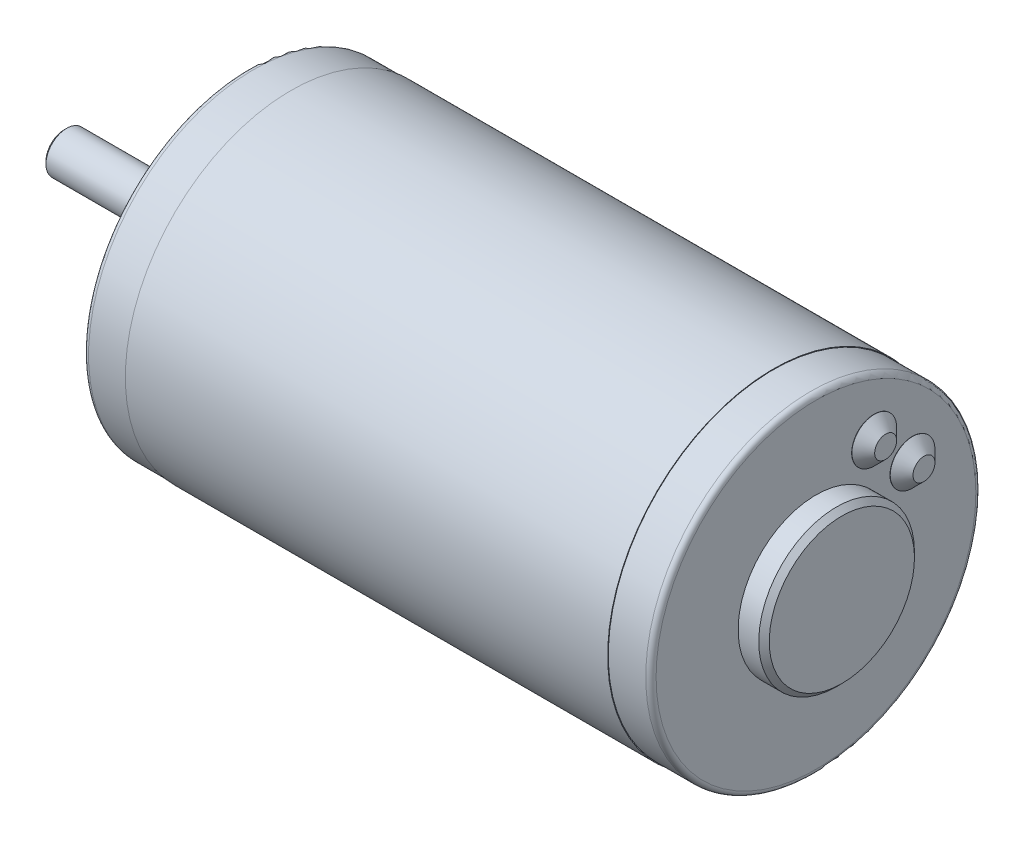
ISO-10303-21;
HEADER;
FILE_DESCRIPTION(('STEP AP214'),'2;1');
FILE_NAME('part.step','',(''),(''),'','','');
FILE_SCHEMA(('AUTOMOTIVE_DESIGN { 1 0 10303 214 1 1 1 1 }'));
ENDSEC;
DATA;
#1=APPLICATION_CONTEXT('core data for automotive mechanical design processes');
#2=APPLICATION_PROTOCOL_DEFINITION('international standard','automotive_design',2000,#1);
#3=PRODUCT_CONTEXT('',#1,'mechanical');
#4=PRODUCT('Part','Part','',(#3));
#5=PRODUCT_RELATED_PRODUCT_CATEGORY('part','',(#4));
#6=PRODUCT_DEFINITION_FORMATION('','',#4);
#7=PRODUCT_DEFINITION_CONTEXT('part definition',#1,'design');
#8=PRODUCT_DEFINITION('design','',#6,#7);
#9=PRODUCT_DEFINITION_SHAPE('','',#8);
#10=(LENGTH_UNIT() NAMED_UNIT(*) SI_UNIT(.MILLI.,.METRE.));
#11=(NAMED_UNIT(*) PLANE_ANGLE_UNIT() SI_UNIT($,.RADIAN.));
#12=(NAMED_UNIT(*) SI_UNIT($,.STERADIAN.) SOLID_ANGLE_UNIT());
#13=UNCERTAINTY_MEASURE_WITH_UNIT(LENGTH_MEASURE(1.E-05),#10,'distance_accuracy_value','');
#14=(GEOMETRIC_REPRESENTATION_CONTEXT(3) GLOBAL_UNCERTAINTY_ASSIGNED_CONTEXT((#13)) GLOBAL_UNIT_ASSIGNED_CONTEXT((#10,
#11,#12)) REPRESENTATION_CONTEXT('',''));
#15=CARTESIAN_POINT('',(0.,0.,0.));
#16=DIRECTION('',(0.,0.,1.));
#17=DIRECTION('',(1.,0.,0.));
#18=AXIS2_PLACEMENT_3D('',#15,#16,#17);
#19=CARTESIAN_POINT('',(-35.6,0.,0.));
#20=DIRECTION('',(-1.,0.,0.));
#21=DIRECTION('',(0.,0.,1.));
#22=AXIS2_PLACEMENT_3D('',#19,#20,#21);
#23=PLANE('',#22);
#24=CARTESIAN_POINT('',(-35.6000000000449,0.,0.));
#25=DIRECTION('',(1.,0.,0.));
#26=DIRECTION('',(0.,0.,-1.));
#27=AXIS2_PLACEMENT_3D('',#24,#25,#26);
#28=CIRCLE('',#27,3.49999999997408);
#29=CARTESIAN_POINT('',(-35.6000000000449,0.,-3.49999999997408));
#30=VERTEX_POINT('',#29);
#31=EDGE_CURVE('E86',#30,#30,#28,.T.);
#32=ORIENTED_EDGE('',*,*,#31,.F.);
#33=EDGE_LOOP('',(#32));
#34=FACE_BOUND('',#33,.T.);
#35=ADVANCED_FACE('F17',(#34),#23,.T.);
#36=CARTESIAN_POINT('',(-27.6,-1.,-2.79999999999999));
#37=DIRECTION('',(0.,0.,1.));
#38=DIRECTION('',(1.,0.,0.));
#39=AXIS2_PLACEMENT_3D('',#36,#37,#38);
#40=PLANE('',#39);
#41=CARTESIAN_POINT('',(-7.1,0.,-2.79999999999999));
#42=DIRECTION('',(0.,0.,-1.));
#43=DIRECTION('',(-1.,0.,0.));
#44=AXIS2_PLACEMENT_3D('',#41,#42,#43);
#45=CIRCLE('',#44,1.);
#46=CARTESIAN_POINT('',(-7.1,1.,-2.79999999999999));
#47=VERTEX_POINT('',#46);
#48=CARTESIAN_POINT('',(-7.1,-1.,-2.79999999999999));
#49=VERTEX_POINT('',#48);
#50=EDGE_CURVE('E355',#47,#49,#45,.T.);
#51=ORIENTED_EDGE('',*,*,#50,.T.);
#52=DIRECTION('',(1.,0.,0.));
#53=VECTOR('',#52,1.);
#54=CARTESIAN_POINT('',(-27.6,-1.,-2.79999999999999));
#55=LINE('',#54,#53);
#56=CARTESIAN_POINT('',(-26.6,-1.,-2.79999999999999));
#57=VERTEX_POINT('',#56);
#58=EDGE_CURVE('E75',#57,#49,#55,.T.);
#59=ORIENTED_EDGE('',*,*,#58,.F.);
#60=CARTESIAN_POINT('',(-26.6,0.,-2.79999999999999));
#61=DIRECTION('',(0.,0.,1.));
#62=DIRECTION('',(1.,0.,0.));
#63=AXIS2_PLACEMENT_3D('',#60,#61,#62);
#64=CIRCLE('',#63,1.);
#65=CARTESIAN_POINT('',(-26.6,1.,-2.79999999999999));
#66=VERTEX_POINT('',#65);
#67=EDGE_CURVE('E77',#57,#66,#64,.F.);
#68=ORIENTED_EDGE('',*,*,#67,.T.);
#69=DIRECTION('',(1.,0.,0.));
#70=VECTOR('',#69,1.);
#71=CARTESIAN_POINT('',(-27.6,1.,-2.79999999999999));
#72=LINE('',#71,#70);
#73=EDGE_CURVE('E80',#66,#47,#72,.T.);
#74=ORIENTED_EDGE('',*,*,#73,.T.);
#75=EDGE_LOOP('',(#51,#59,#68,#74));
#76=FACE_BOUND('',#75,.T.);
#77=ADVANCED_FACE('F79',(#76),#40,.F.);
#78=CARTESIAN_POINT('',(-27.6,1.,-2.79999999999999));
#79=DIRECTION('',(0.,1.,0.));
#80=DIRECTION('',(0.,0.,1.));
#81=AXIS2_PLACEMENT_3D('',#78,#79,#80);
#82=PLANE('',#81);
#83=DIRECTION('',(0.,0.,-1.));
#84=VECTOR('',#83,1.);
#85=CARTESIAN_POINT('',(-7.1,1.,-2.79999999999999));
#86=LINE('',#85,#84);
#87=CARTESIAN_POINT('',(-7.1,1.,-3.87298334620741));
#88=VERTEX_POINT('',#87);
#89=EDGE_CURVE('E94',#88,#47,#86,.F.);
#90=ORIENTED_EDGE('',*,*,#89,.T.);
#91=ORIENTED_EDGE('',*,*,#73,.F.);
#92=DIRECTION('',(0.,0.,1.));
#93=VECTOR('',#92,1.);
#94=CARTESIAN_POINT('',(-26.6,1.,-3.87298334620741));
#95=LINE('',#94,#93);
#96=CARTESIAN_POINT('',(-26.6,1.,-3.87298334620741));
#97=VERTEX_POINT('',#96);
#98=EDGE_CURVE('E85',#66,#97,#95,.F.);
#99=ORIENTED_EDGE('',*,*,#98,.T.);
#100=DIRECTION('',(1.,0.,0.));
#101=VECTOR('',#100,1.);
#102=CARTESIAN_POINT('',(0.,1.,-3.87298334620741));
#103=LINE('',#102,#101);
#104=EDGE_CURVE('E108',#88,#97,#103,.F.);
#105=ORIENTED_EDGE('',*,*,#104,.F.);
#106=EDGE_LOOP('',(#90,#91,#99,#105));
#107=FACE_BOUND('',#106,.T.);
#108=ADVANCED_FACE('F90',(#107),#82,.F.);
#109=CARTESIAN_POINT('',(-35.0999999999999,0.,0.));
#110=DIRECTION('',(1.,0.,0.));
#111=DIRECTION('',(0.,0.,-1.));
#112=AXIS2_PLACEMENT_3D('',#109,#110,#111);
#113=CONICAL_SURFACE('',#112,3.99999999996226,0.785398163340605);
#114=ORIENTED_EDGE('',*,*,#31,.T.);
#115=EDGE_LOOP('',(#114));
#116=FACE_BOUND('',#115,.T.);
#117=CARTESIAN_POINT('',(-35.1,0.,0.));
#118=DIRECTION('',(1.,0.,0.));
#119=DIRECTION('',(0.,0.,-1.));
#120=AXIS2_PLACEMENT_3D('',#117,#118,#119);
#121=CIRCLE('',#120,4.);
#122=CARTESIAN_POINT('',(-35.1,0.,-4.));
#123=VERTEX_POINT('',#122);
#124=EDGE_CURVE('E106',#123,#123,#121,.T.);
#125=ORIENTED_EDGE('',*,*,#124,.F.);
#126=EDGE_LOOP('',(#125));
#127=FACE_BOUND('',#126,.T.);
#128=ADVANCED_FACE('F449',(#116,#127),#113,.T.);
#129=CARTESIAN_POINT('',(-26.6,0.,-3.87298334620741));
#130=DIRECTION('',(0.,0.,1.));
#131=DIRECTION('',(1.,0.,0.));
#132=AXIS2_PLACEMENT_3D('',#129,#130,#131);
#133=CYLINDRICAL_SURFACE('',#132,1.);
#134=CARTESIAN_POINT('',(-26.6,1.,-3.87298334620741));
#135=CARTESIAN_POINT('',(-26.6276629618862,1.00000033683282,-3.87298148578628));
#136=CARTESIAN_POINT('',(-26.6553122166168,0.998851408973519,-3.87328009898513));
#137=CARTESIAN_POINT('',(-26.7104039432582,0.99427130530857,-3.87445904529397));
#138=CARTESIAN_POINT('',(-26.7378464491771,0.990840513520934,-3.87533928052183));
#139=CARTESIAN_POINT('',(-26.8194530833432,0.977175260843417,-3.87881710393726));
#140=CARTESIAN_POINT('',(-26.8730564246123,0.963567703685293,-3.88225202757006));
#141=CARTESIAN_POINT('',(-26.977125593587,0.927797766664205,-3.89095430304382));
#142=CARTESIAN_POINT('',(-27.0275916629555,0.905636046675282,-3.89622151353779));
#143=CARTESIAN_POINT('',(-27.1241130864299,0.853414285079073,-3.90799157486739));
#144=CARTESIAN_POINT('',(-27.1701674100591,0.823352404294525,-3.91449471333242));
#145=CARTESIAN_POINT('',(-27.2575394864378,0.755487979247931,-3.92816193945039));
#146=CARTESIAN_POINT('',(-27.2987466452781,0.717545201468668,-3.9353364874883));
#147=CARTESIAN_POINT('',(-27.374295287631,0.635284227526783,-3.94944965646411));
#148=CARTESIAN_POINT('',(-27.4086343067441,0.590963752716545,-3.95638819197841));
#149=CARTESIAN_POINT('',(-27.4699263913366,0.496434353262424,-3.969365132807));
#150=CARTESIAN_POINT('',(-27.4967663594361,0.446150035120253,-3.97538918749288));
#151=CARTESIAN_POINT('',(-27.5415435234846,0.341642316384397,-3.98572777190495));
#152=CARTESIAN_POINT('',(-27.5594913901323,0.287423727052285,-3.99004434937703));
#153=CARTESIAN_POINT('',(-27.5817561327113,0.194111735626857,-3.99546891720265));
#154=CARTESIAN_POINT('',(-27.5885857933547,0.155632918020193,-3.99715927898668));
#155=CARTESIAN_POINT('',(-27.5977085408135,0.0781080027780982,-3.99942531582645));
#156=CARTESIAN_POINT('',(-27.6000016937716,0.0390619134219042,-4.00000100713419));
#157=CARTESIAN_POINT('',(-27.599997605085,-0.0552317459833931,-3.99999857595864));
#158=CARTESIAN_POINT('',(-27.5954072017814,-0.110495128478836,-3.99884417849431));
#159=CARTESIAN_POINT('',(-27.5771887284744,-0.219452299234418,-3.99434884496973));
#160=CARTESIAN_POINT('',(-27.5635520456883,-0.273144540728258,-3.99100582520556));
#161=CARTESIAN_POINT('',(-27.5277065776784,-0.377348216031198,-3.98250401525138));
#162=CARTESIAN_POINT('',(-27.50550949133,-0.427863881926155,-3.97734770399773));
#163=CARTESIAN_POINT('',(-27.4532106110736,-0.524450982676872,-3.96576858613919));
#164=CARTESIAN_POINT('',(-27.423109018223,-0.57052253053142,-3.9593458117488));
#165=CARTESIAN_POINT('',(-27.3552003629654,-0.657866871057273,-3.94578291730051));
#166=CARTESIAN_POINT('',(-27.3172610821916,-0.699035148909366,-3.93863172676562));
#167=CARTESIAN_POINT('',(-27.2350335448416,-0.774497762760055,-3.92449111086286));
#168=CARTESIAN_POINT('',(-27.19074427933,-0.808791004318421,-3.917501711407));
#169=CARTESIAN_POINT('',(-27.0962571540367,-0.870026617564649,-3.90436326544461));
#170=CARTESIAN_POINT('',(-27.0459800204073,-0.896849892050558,-3.89822853701072));
#171=CARTESIAN_POINT('',(-26.9414633719414,-0.94160949320265,-3.88766043493567));
#172=CARTESIAN_POINT('',(-26.8872268673446,-0.959552492279162,-3.88322578446617));
#173=CARTESIAN_POINT('',(-26.7939162001483,-0.981793057388551,-3.87765011739135));
#174=CARTESIAN_POINT('',(-26.7554596460299,-0.988610024876977,-3.87591131774124));
#175=CARTESIAN_POINT('',(-26.6780089785749,-0.997716332082784,-3.87357302813836));
#176=CARTESIAN_POINT('',(-26.6390152728012,-1.00000893261029,-3.87297271766376));
#177=CARTESIAN_POINT('',(-26.6,-1.,-3.87298334620741));
#178=B_SPLINE_CURVE_WITH_KNOTS('',3,(#134,#135,#136,#137,#138,#139,#140,#141,#142,#143,#144,
#145,#146,#147,#148,#149,#150,#151,#152,#153,#154,#155,#156,#157,#158,#159,#160,#161,#162,#163,
#164,#165,#166,#167,#168,#169,#170,#171,#172,#173,#174,#175,#176,#177),.UNSPECIFIED.,.F.,.F.,(4,
2,2,2,2,2,2,2,2,2,2,2,2,2,2,2,2,2,2,2,2,4),(0.,0.0829364608197381,0.165858967679134,
0.331229962709977,0.496588203456513,0.661984974171246,0.830625162094532,0.999325752711569,
1.17044795789403,1.34136431261154,1.45844938979968,1.57553275986411,1.74108325106591,
1.9067915862414,2.07227425793989,2.23775272086784,2.40629176845251,2.57485762457941,
2.74597444954042,2.91696250578417,3.03398040676348,3.15091393953944),.UNSPECIFIED.);
#179=CARTESIAN_POINT('',(-26.6,-1.,-3.87298334620741));
#180=VERTEX_POINT('',#179);
#181=EDGE_CURVE('E99',#97,#180,#178,.T.);
#182=ORIENTED_EDGE('',*,*,#181,.F.);
#183=ORIENTED_EDGE('',*,*,#98,.F.);
#184=ORIENTED_EDGE('',*,*,#67,.F.);
#185=DIRECTION('',(0.,0.,1.));
#186=VECTOR('',#185,1.);
#187=CARTESIAN_POINT('',(-26.6,-1.,-2.79999999999999));
#188=LINE('',#187,#186);
#189=EDGE_CURVE('E101',#180,#57,#188,.T.);
#190=ORIENTED_EDGE('',*,*,#189,.F.);
#191=EDGE_LOOP('',(#182,#183,#184,#190));
#192=FACE_BOUND('',#191,.T.);
#193=ADVANCED_FACE('F97',(#192),#133,.F.);
#194=CARTESIAN_POINT('',(-27.6,-1.,-2.79999999999999));
#195=DIRECTION('',(0.,1.,0.));
#196=DIRECTION('',(0.,0.,1.));
#197=AXIS2_PLACEMENT_3D('',#194,#195,#196);
#198=PLANE('',#197);
#199=DIRECTION('',(1.,0.,0.));
#200=VECTOR('',#199,1.);
#201=CARTESIAN_POINT('',(0.,-1.,-3.87298334620741));
#202=LINE('',#201,#200);
#203=CARTESIAN_POINT('',(-7.1,-1.,-3.87298334620741));
#204=VERTEX_POINT('',#203);
#205=EDGE_CURVE('E162',#180,#204,#202,.T.);
#206=ORIENTED_EDGE('',*,*,#205,.F.);
#207=ORIENTED_EDGE('',*,*,#189,.T.);
#208=ORIENTED_EDGE('',*,*,#58,.T.);
#209=DIRECTION('',(0.,0.,-1.));
#210=VECTOR('',#209,1.);
#211=CARTESIAN_POINT('',(-7.1,-1.,-2.79999999999999));
#212=LINE('',#211,#210);
#213=EDGE_CURVE('E354',#49,#204,#212,.T.);
#214=ORIENTED_EDGE('',*,*,#213,.T.);
#215=EDGE_LOOP('',(#206,#207,#208,#214));
#216=FACE_BOUND('',#215,.T.);
#217=ADVANCED_FACE('F358',(#216),#198,.T.);
#218=CARTESIAN_POINT('',(-7.1,0.,-2.79999999999999));
#219=DIRECTION('',(0.,0.,-1.));
#220=DIRECTION('',(-1.,0.,0.));
#221=AXIS2_PLACEMENT_3D('',#218,#219,#220);
#222=CYLINDRICAL_SURFACE('',#221,1.);
#223=ORIENTED_EDGE('',*,*,#50,.F.);
#224=ORIENTED_EDGE('',*,*,#89,.F.);
#225=CARTESIAN_POINT('',(-7.1,-1.,-3.87298334620741));
#226=CARTESIAN_POINT('',(-7.07233703811384,-1.00000033683282,-3.87298148578628));
#227=CARTESIAN_POINT('',(-7.04468778338315,-0.998851408973519,-3.87328009898513));
#228=CARTESIAN_POINT('',(-6.98959605674182,-0.994271305308569,-3.87445904529398));
#229=CARTESIAN_POINT('',(-6.96215355082289,-0.990840513520934,-3.87533928052183));
#230=CARTESIAN_POINT('',(-6.88054691665678,-0.977175260843416,-3.87881710393726));
#231=CARTESIAN_POINT('',(-6.82694357538774,-0.963567703685292,-3.88225202757006));
#232=CARTESIAN_POINT('',(-6.72287440641297,-0.927797766664205,-3.89095430304382));
#233=CARTESIAN_POINT('',(-6.67240833704446,-0.905636046675282,-3.89622151353779));
#234=CARTESIAN_POINT('',(-6.57588691357012,-0.853414285079073,-3.90799157486739));
#235=CARTESIAN_POINT('',(-6.52983258994087,-0.823352404294525,-3.91449471333242));
#236=CARTESIAN_POINT('',(-6.44246051356216,-0.755487979247931,-3.92816193945039));
#237=CARTESIAN_POINT('',(-6.40125335472187,-0.717545201468668,-3.9353364874883));
#238=CARTESIAN_POINT('',(-6.32570471236899,-0.635284227526783,-3.94944965646411));
#239=CARTESIAN_POINT('',(-6.29136569325587,-0.590963752716545,-3.95638819197841));
#240=CARTESIAN_POINT('',(-6.23007360866341,-0.496434353262424,-3.969365132807));
#241=CARTESIAN_POINT('',(-6.20323364056389,-0.446150035120253,-3.97538918749288));
#242=CARTESIAN_POINT('',(-6.1584564765154,-0.341642316384397,-3.98572777190495));
#243=CARTESIAN_POINT('',(-6.1405086098677,-0.287423727052285,-3.99004434937703));
#244=CARTESIAN_POINT('',(-6.11824386728865,-0.194111735626858,-3.99546891720265));
#245=CARTESIAN_POINT('',(-6.11141420664531,-0.155632918020193,-3.99715927898668));
#246=CARTESIAN_POINT('',(-6.10229145918653,-0.0781080027780987,-3.99942531582645));
#247=CARTESIAN_POINT('',(-6.09999830622839,-0.0390619134219048,-4.00000100713419));
#248=CARTESIAN_POINT('',(-6.10000239491503,0.0552317459833926,-3.99999857595864));
#249=CARTESIAN_POINT('',(-6.10459279821858,0.110495128478836,-3.99884417849431));
#250=CARTESIAN_POINT('',(-6.12281127152564,0.219452299234417,-3.99434884496973));
#251=CARTESIAN_POINT('',(-6.13644795431172,0.273144540728257,-3.99100582520556));
#252=CARTESIAN_POINT('',(-6.17229342232156,0.377348216031196,-3.98250401525138));
#253=CARTESIAN_POINT('',(-6.19449050867005,0.427863881926154,-3.97734770399773));
#254=CARTESIAN_POINT('',(-6.24678938892637,0.524450982676871,-3.96576858613919));
#255=CARTESIAN_POINT('',(-6.27689098177704,0.570522530531419,-3.95934581174879));
#256=CARTESIAN_POINT('',(-6.34479963703464,0.657866871057273,-3.94578291730051));
#257=CARTESIAN_POINT('',(-6.38273891780836,0.699035148909367,-3.93863172676562));
#258=CARTESIAN_POINT('',(-6.46496645515838,0.774497762760056,-3.92449111086286));
#259=CARTESIAN_POINT('',(-6.50925572067002,0.808791004318422,-3.917501711407));
#260=CARTESIAN_POINT('',(-6.60374284596331,0.870026617564649,-3.90436326544461));
#261=CARTESIAN_POINT('',(-6.65401997959268,0.896849892050559,-3.89822853701072));
#262=CARTESIAN_POINT('',(-6.75853662805855,0.941609493202651,-3.88766043493567));
#263=CARTESIAN_POINT('',(-6.81277313265544,0.959552492279163,-3.88322578446617));
#264=CARTESIAN_POINT('',(-6.90608379985171,0.981793057388551,-3.87765011739135));
#265=CARTESIAN_POINT('',(-6.9445403539701,0.988610024876977,-3.87591131774124));
#266=CARTESIAN_POINT('',(-7.02199102142509,0.997716332082784,-3.87357302813836));
#267=CARTESIAN_POINT('',(-7.06098472719881,1.00000893261029,-3.87297271766376));
#268=CARTESIAN_POINT('',(-7.1,1.,-3.87298334620741));
#269=B_SPLINE_CURVE_WITH_KNOTS('',3,(#225,#226,#227,#228,#229,#230,#231,#232,#233,#234,#235,
#236,#237,#238,#239,#240,#241,#242,#243,#244,#245,#246,#247,#248,#249,#250,#251,#252,#253,#254,
#255,#256,#257,#258,#259,#260,#261,#262,#263,#264,#265,#266,#267,#268),.UNSPECIFIED.,.F.,.F.,(4,
2,2,2,2,2,2,2,2,2,2,2,2,2,2,2,2,2,2,2,2,4),(0.,0.0829364608197424,0.165858967679138,
0.331229962709977,0.496588203456512,0.661984974171246,0.830625162094531,0.999325752711568,
1.17044795789403,1.34136431261154,1.45844938979968,1.57553275986411,1.74108325106591,
1.9067915862414,2.07227425793989,2.23775272086784,2.40629176845251,2.57485762457941,
2.74597444954042,2.91696250578417,3.03398040676347,3.15091393953944),.UNSPECIFIED.);
#270=EDGE_CURVE('E155',#204,#88,#269,.T.);
#271=ORIENTED_EDGE('',*,*,#270,.F.);
#272=ORIENTED_EDGE('',*,*,#213,.F.);
#273=EDGE_LOOP('',(#223,#224,#271,#272));
#274=FACE_BOUND('',#273,.T.);
#275=ADVANCED_FACE('F168',(#274),#222,.F.);
#276=CARTESIAN_POINT('',(0.,0.,0.));
#277=DIRECTION('',(1.,0.,0.));
#278=DIRECTION('',(0.,0.,-1.));
#279=AXIS2_PLACEMENT_3D('',#276,#277,#278);
#280=CYLINDRICAL_SURFACE('',#279,4.);
#281=ORIENTED_EDGE('',*,*,#124,.T.);
#282=EDGE_LOOP('',(#281));
#283=FACE_BOUND('',#282,.T.);
#284=ORIENTED_EDGE('',*,*,#104,.T.);
#285=ORIENTED_EDGE('',*,*,#181,.T.);
#286=ORIENTED_EDGE('',*,*,#205,.T.);
#287=ORIENTED_EDGE('',*,*,#270,.T.);
#288=EDGE_LOOP('',(#284,#285,#286,#287));
#289=FACE_BOUND('',#288,.T.);
#290=CARTESIAN_POINT('',(-4.,0.,0.));
#291=DIRECTION('',(1.,0.,0.));
#292=DIRECTION('',(0.,0.,-1.));
#293=AXIS2_PLACEMENT_3D('',#290,#291,#292);
#294=CIRCLE('',#293,4.);
#295=CARTESIAN_POINT('',(-4.,0.,-4.));
#296=VERTEX_POINT('',#295);
#297=EDGE_CURVE('E152',#296,#296,#294,.T.);
#298=ORIENTED_EDGE('',*,*,#297,.F.);
#299=EDGE_LOOP('',(#298));
#300=FACE_BOUND('',#299,.T.);
#301=ADVANCED_FACE('F171',(#283,#289,#300),#280,.T.);
#302=CARTESIAN_POINT('',(-4.,4.,0.));
#303=DIRECTION('',(-1.,0.,0.));
#304=DIRECTION('',(0.,0.,1.));
#305=AXIS2_PLACEMENT_3D('',#302,#303,#304);
#306=PLANE('',#305);
#307=ORIENTED_EDGE('',*,*,#297,.T.);
#308=EDGE_LOOP('',(#307));
#309=FACE_BOUND('',#308,.T.);
#310=CARTESIAN_POINT('',(-4.,0.,0.));
#311=DIRECTION('',(1.,0.,0.));
#312=DIRECTION('',(0.,1.,0.));
#313=AXIS2_PLACEMENT_3D('',#310,#311,#312);
#314=CIRCLE('',#313,8.509);
#315=CARTESIAN_POINT('',(-4.,8.509,0.));
#316=VERTEX_POINT('',#315);
#317=EDGE_CURVE('E149',#316,#316,#314,.T.);
#318=ORIENTED_EDGE('',*,*,#317,.F.);
#319=EDGE_LOOP('',(#318));
#320=FACE_BOUND('',#319,.T.);
#321=ADVANCED_FACE('F175',(#309,#320),#306,.T.);
#322=CARTESIAN_POINT('',(111.8479,11.2073596390943,-18.6070906828553));
#323=DIRECTION('',(1.,0.,0.));
#324=DIRECTION('',(0.,0.,-1.));
#325=AXIS2_PLACEMENT_3D('',#322,#323,#324);
#326=PLANE('',#325);
#327=CARTESIAN_POINT('',(111.84789999993,11.2073596390943,-18.6070906828553));
#328=DIRECTION('',(-1.,0.,0.));
#329=DIRECTION('',(0.,0.,1.));
#330=AXIS2_PLACEMENT_3D('',#327,#328,#329);
#331=CIRCLE('',#330,2.1180000000021);
#332=CARTESIAN_POINT('',(111.84789999993,11.2073596390943,-16.4890906828532));
#333=VERTEX_POINT('',#332);
#334=EDGE_CURVE('E146',#333,#333,#331,.T.);
#335=ORIENTED_EDGE('',*,*,#334,.F.);
#336=EDGE_LOOP('',(#335));
#337=FACE_BOUND('',#336,.T.);
#338=ADVANCED_FACE('F180',(#337),#326,.T.);
#339=CARTESIAN_POINT('',(111.8479,18.6070906828553,-11.2073596390943));
#340=DIRECTION('',(1.,0.,0.));
#341=DIRECTION('',(0.,0.,-1.));
#342=AXIS2_PLACEMENT_3D('',#339,#340,#341);
#343=PLANE('',#342);
#344=CARTESIAN_POINT('',(111.84789999993,18.6070906828553,-11.2073596390943));
#345=DIRECTION('',(-1.,0.,0.));
#346=DIRECTION('',(0.,-1.,0.));
#347=AXIS2_PLACEMENT_3D('',#344,#345,#346);
#348=CIRCLE('',#347,2.11800000003146);
#349=CARTESIAN_POINT('',(111.84789999993,16.4890906828238,-11.2073596390943));
#350=VERTEX_POINT('',#349);
#351=EDGE_CURVE('E143',#350,#350,#348,.T.);
#352=ORIENTED_EDGE('',*,*,#351,.F.);
#353=EDGE_LOOP('',(#352));
#354=FACE_BOUND('',#353,.T.);
#355=ADVANCED_FACE('F184',(#354),#343,.T.);
#356=CARTESIAN_POINT('',(114.6,15.0368,0.));
#357=DIRECTION('',(1.,0.,0.));
#358=DIRECTION('',(0.,0.,-1.));
#359=AXIS2_PLACEMENT_3D('',#356,#357,#358);
#360=PLANE('',#359);
#361=CARTESIAN_POINT('',(114.6,0.,0.));
#362=DIRECTION('',(-1.,0.,0.));
#363=DIRECTION('',(0.,-1.,0.));
#364=AXIS2_PLACEMENT_3D('',#361,#362,#363);
#365=CIRCLE('',#364,14.0208);
#366=CARTESIAN_POINT('',(114.6,-14.0208,0.));
#367=VERTEX_POINT('',#366);
#368=EDGE_CURVE('E139',#367,#367,#365,.T.);
#369=ORIENTED_EDGE('',*,*,#368,.F.);
#370=EDGE_LOOP('',(#369));
#371=FACE_BOUND('',#370,.T.);
#372=ADVANCED_FACE('F188',(#371),#360,.T.);
#373=CARTESIAN_POINT('',(13.6143999999945,25.4,0.));
#374=DIRECTION('',(-1.,0.,0.));
#375=DIRECTION('',(0.,0.,1.));
#376=AXIS2_PLACEMENT_3D('',#373,#374,#375);
#377=CONICAL_SURFACE('',#376,2.01929999997219,1.02974425867198);
#378=CARTESIAN_POINT('',(14.827717847993,25.4,0.));
#379=VERTEX_POINT('',#378);
#380=VERTEX_LOOP('',#379);
#381=FACE_BOUND('',#380,.T.);
#382=CARTESIAN_POINT('',(13.6144,25.4,0.));
#383=DIRECTION('',(-1.,0.,0.));
#384=DIRECTION('',(0.,0.,1.));
#385=AXIS2_PLACEMENT_3D('',#382,#383,#384);
#386=CIRCLE('',#385,2.0193);
#387=CARTESIAN_POINT('',(13.6144,25.4,2.0193));
#388=VERTEX_POINT('',#387);
#389=EDGE_CURVE('E142',#388,#388,#386,.T.);
#390=ORIENTED_EDGE('',*,*,#389,.T.);
#391=EDGE_LOOP('',(#390));
#392=FACE_BOUND('',#391,.T.);
#393=ADVANCED_FACE('F192',(#381,#392),#377,.F.);
#394=CARTESIAN_POINT('',(13.6143999999945,-25.4,0.));
#395=DIRECTION('',(-1.,0.,0.));
#396=DIRECTION('',(0.,0.,1.));
#397=AXIS2_PLACEMENT_3D('',#394,#395,#396);
#398=CONICAL_SURFACE('',#397,2.01929999997219,1.02974425867198);
#399=CARTESIAN_POINT('',(14.827717847993,-25.4,0.));
#400=VERTEX_POINT('',#399);
#401=VERTEX_LOOP('',#400);
#402=FACE_BOUND('',#401,.T.);
#403=CARTESIAN_POINT('',(13.6144,-25.4,0.));
#404=DIRECTION('',(-1.,0.,0.));
#405=DIRECTION('',(0.,0.,1.));
#406=AXIS2_PLACEMENT_3D('',#403,#404,#405);
#407=CIRCLE('',#406,2.0193);
#408=CARTESIAN_POINT('',(13.6144,-25.4,2.0193));
#409=VERTEX_POINT('',#408);
#410=EDGE_CURVE('E343',#409,#409,#407,.T.);
#411=ORIENTED_EDGE('',*,*,#410,.T.);
#412=EDGE_LOOP('',(#411));
#413=FACE_BOUND('',#412,.T.);
#414=ADVANCED_FACE('F196',(#402,#413),#398,.F.);
#415=CARTESIAN_POINT('',(-2.984,0.,0.));
#416=DIRECTION('',(1.,0.,0.));
#417=DIRECTION('',(0.,1.,0.));
#418=AXIS2_PLACEMENT_3D('',#415,#416,#417);
#419=CONICAL_SURFACE('',#418,9.525,0.78539816339745);
#420=ORIENTED_EDGE('',*,*,#317,.T.);
#421=EDGE_LOOP('',(#420));
#422=FACE_BOUND('',#421,.T.);
#423=CARTESIAN_POINT('',(-2.984,0.,0.));
#424=DIRECTION('',(1.,0.,0.));
#425=DIRECTION('',(0.,0.,-1.));
#426=AXIS2_PLACEMENT_3D('',#423,#424,#425);
#427=CIRCLE('',#426,9.525);
#428=CARTESIAN_POINT('',(-2.984,0.,-9.525));
#429=VERTEX_POINT('',#428);
#430=EDGE_CURVE('E338',#429,#429,#427,.T.);
#431=ORIENTED_EDGE('',*,*,#430,.F.);
#432=EDGE_LOOP('',(#431));
#433=FACE_BOUND('',#432,.T.);
#434=ADVANCED_FACE('F200',(#422,#433),#419,.T.);
#435=CARTESIAN_POINT('',(109.647900000084,11.2073596390943,-18.6070906828553));
#436=DIRECTION('',(-1.,0.,0.));
#437=DIRECTION('',(0.,0.,1.));
#438=AXIS2_PLACEMENT_3D('',#435,#436,#437);
#439=CONICAL_SURFACE('',#438,4.31799999990461,0.785398163410367);
#440=CARTESIAN_POINT('',(109.6479,11.2073596390943,-18.6070906828553));
#441=DIRECTION('',(-1.,0.,0.));
#442=DIRECTION('',(0.,0.,1.));
#443=AXIS2_PLACEMENT_3D('',#440,#441,#442);
#444=CIRCLE('',#443,4.318);
#445=CARTESIAN_POINT('',(109.6479,11.2073596390943,-14.2890906828553));
#446=VERTEX_POINT('',#445);
#447=EDGE_CURVE('E336',#446,#446,#444,.T.);
#448=ORIENTED_EDGE('',*,*,#447,.F.);
#449=EDGE_LOOP('',(#448));
#450=FACE_BOUND('',#449,.T.);
#451=ORIENTED_EDGE('',*,*,#334,.T.);
#452=EDGE_LOOP('',(#451));
#453=FACE_BOUND('',#452,.T.);
#454=ADVANCED_FACE('F204',(#450,#453),#439,.T.);
#455=CARTESIAN_POINT('',(109.647900000027,18.6070906828553,-11.2073596390943));
#456=DIRECTION('',(-1.,0.,0.));
#457=DIRECTION('',(0.,-1.,0.));
#458=AXIS2_PLACEMENT_3D('',#455,#456,#457);
#459=CONICAL_SURFACE('',#458,4.31799999987712,0.785398163384529);
#460=CARTESIAN_POINT('',(109.6479,18.6070906828553,-11.2073596390943));
#461=DIRECTION('',(-1.,0.,0.));
#462=DIRECTION('',(0.,0.,1.));
#463=AXIS2_PLACEMENT_3D('',#460,#461,#462);
#464=CIRCLE('',#463,4.318);
#465=CARTESIAN_POINT('',(109.6479,18.6070906828553,-6.88935963909434));
#466=VERTEX_POINT('',#465);
#467=EDGE_CURVE('E337',#466,#466,#464,.T.);
#468=ORIENTED_EDGE('',*,*,#467,.F.);
#469=EDGE_LOOP('',(#468));
#470=FACE_BOUND('',#469,.T.);
#471=ORIENTED_EDGE('',*,*,#351,.T.);
#472=EDGE_LOOP('',(#471));
#473=FACE_BOUND('',#472,.T.);
#474=ADVANCED_FACE('F208',(#470,#473),#459,.T.);
#475=CARTESIAN_POINT('',(113.584,0.,0.));
#476=DIRECTION('',(-1.,0.,0.));
#477=DIRECTION('',(0.,-1.,0.));
#478=AXIS2_PLACEMENT_3D('',#475,#476,#477);
#479=CONICAL_SURFACE('',#478,15.0368,0.785398163397441);
#480=ORIENTED_EDGE('',*,*,#368,.T.);
#481=EDGE_LOOP('',(#480));
#482=FACE_BOUND('',#481,.T.);
#483=CARTESIAN_POINT('',(113.584,0.,0.));
#484=DIRECTION('',(1.,0.,0.));
#485=DIRECTION('',(0.,0.,-1.));
#486=AXIS2_PLACEMENT_3D('',#483,#484,#485);
#487=CIRCLE('',#486,15.0368);
#488=CARTESIAN_POINT('',(113.584,0.,-15.0368));
#489=VERTEX_POINT('',#488);
#490=EDGE_CURVE('E138',#489,#489,#487,.F.);
#491=ORIENTED_EDGE('',*,*,#490,.F.);
#492=EDGE_LOOP('',(#491));
#493=FACE_BOUND('',#492,.T.);
#494=ADVANCED_FACE('F212',(#482,#493),#479,.T.);
#495=CARTESIAN_POINT('',(0.,25.4,0.));
#496=DIRECTION('',(-1.,0.,0.));
#497=DIRECTION('',(0.,0.,1.));
#498=AXIS2_PLACEMENT_3D('',#495,#496,#497);
#499=CYLINDRICAL_SURFACE('',#498,2.0193);
#500=CARTESIAN_POINT('',(0.,25.4,0.));
#501=DIRECTION('',(-1.,0.,0.));
#502=DIRECTION('',(0.,0.,1.));
#503=AXIS2_PLACEMENT_3D('',#500,#501,#502);
#504=CIRCLE('',#503,2.0193);
#505=CARTESIAN_POINT('',(0.,25.4,2.0193));
#506=VERTEX_POINT('',#505);
#507=EDGE_CURVE('E135',#506,#506,#504,.F.);
#508=ORIENTED_EDGE('',*,*,#507,.F.);
#509=EDGE_LOOP('',(#508));
#510=FACE_BOUND('',#509,.T.);
#511=ORIENTED_EDGE('',*,*,#389,.F.);
#512=EDGE_LOOP('',(#511));
#513=FACE_BOUND('',#512,.T.);
#514=ADVANCED_FACE('F216',(#510,#513),#499,.F.);
#515=CARTESIAN_POINT('',(0.,-25.4,0.));
#516=DIRECTION('',(-1.,0.,0.));
#517=DIRECTION('',(0.,0.,1.));
#518=AXIS2_PLACEMENT_3D('',#515,#516,#517);
#519=CYLINDRICAL_SURFACE('',#518,2.0193);
#520=CARTESIAN_POINT('',(0.,-25.4,0.));
#521=DIRECTION('',(-1.,0.,0.));
#522=DIRECTION('',(0.,0.,1.));
#523=AXIS2_PLACEMENT_3D('',#520,#521,#522);
#524=CIRCLE('',#523,2.0193);
#525=CARTESIAN_POINT('',(0.,-25.4,2.0193));
#526=VERTEX_POINT('',#525);
#527=EDGE_CURVE('E132',#526,#526,#524,.F.);
#528=ORIENTED_EDGE('',*,*,#527,.F.);
#529=EDGE_LOOP('',(#528));
#530=FACE_BOUND('',#529,.T.);
#531=ORIENTED_EDGE('',*,*,#410,.F.);
#532=EDGE_LOOP('',(#531));
#533=FACE_BOUND('',#532,.T.);
#534=ADVANCED_FACE('F220',(#530,#533),#519,.F.);
#535=CARTESIAN_POINT('',(0.,0.,0.));
#536=DIRECTION('',(1.,0.,0.));
#537=DIRECTION('',(0.,0.,-1.));
#538=AXIS2_PLACEMENT_3D('',#535,#536,#537);
#539=CYLINDRICAL_SURFACE('',#538,9.525);
#540=ORIENTED_EDGE('',*,*,#430,.T.);
#541=EDGE_LOOP('',(#540));
#542=FACE_BOUND('',#541,.T.);
#543=CARTESIAN_POINT('',(0.,0.,0.));
#544=DIRECTION('',(1.,0.,0.));
#545=DIRECTION('',(0.,0.,-1.));
#546=AXIS2_PLACEMENT_3D('',#543,#544,#545);
#547=CIRCLE('',#546,9.525);
#548=CARTESIAN_POINT('',(0.,0.,-9.525));
#549=VERTEX_POINT('',#548);
#550=EDGE_CURVE('E129',#549,#549,#547,.T.);
#551=ORIENTED_EDGE('',*,*,#550,.F.);
#552=EDGE_LOOP('',(#551));
#553=FACE_BOUND('',#552,.T.);
#554=ADVANCED_FACE('F224',(#542,#553),#539,.T.);
#555=CARTESIAN_POINT('',(111.8479,11.2073596390943,-18.6070906828553));
#556=DIRECTION('',(-1.,0.,0.));
#557=DIRECTION('',(0.,0.,1.));
#558=AXIS2_PLACEMENT_3D('',#555,#556,#557);
#559=CYLINDRICAL_SURFACE('',#558,4.318);
#560=CARTESIAN_POINT('',(109.6,11.2073596390943,-18.6070906828553));
#561=DIRECTION('',(-1.,0.,0.));
#562=DIRECTION('',(0.,0.,1.));
#563=AXIS2_PLACEMENT_3D('',#560,#561,#562);
#564=CIRCLE('',#563,4.318);
#565=CARTESIAN_POINT('',(109.6,11.2073596390943,-14.2890906828553));
#566=VERTEX_POINT('',#565);
#567=EDGE_CURVE('E126',#566,#566,#564,.T.);
#568=ORIENTED_EDGE('',*,*,#567,.F.);
#569=EDGE_LOOP('',(#568));
#570=FACE_BOUND('',#569,.T.);
#571=ORIENTED_EDGE('',*,*,#447,.T.);
#572=EDGE_LOOP('',(#571));
#573=FACE_BOUND('',#572,.T.);
#574=ADVANCED_FACE('F228',(#570,#573),#559,.T.);
#575=CARTESIAN_POINT('',(111.8479,18.6070906828553,-11.2073596390943));
#576=DIRECTION('',(-1.,0.,0.));
#577=DIRECTION('',(0.,0.,1.));
#578=AXIS2_PLACEMENT_3D('',#575,#576,#577);
#579=CYLINDRICAL_SURFACE('',#578,4.318);
#580=CARTESIAN_POINT('',(109.6,18.6070906828553,-11.2073596390943));
#581=DIRECTION('',(-1.,0.,0.));
#582=DIRECTION('',(0.,0.,1.));
#583=AXIS2_PLACEMENT_3D('',#580,#581,#582);
#584=CIRCLE('',#583,4.318);
#585=CARTESIAN_POINT('',(109.6,18.6070906828553,-6.88935963909434));
#586=VERTEX_POINT('',#585);
#587=EDGE_CURVE('E123',#586,#586,#584,.T.);
#588=ORIENTED_EDGE('',*,*,#587,.F.);
#589=EDGE_LOOP('',(#588));
#590=FACE_BOUND('',#589,.T.);
#591=ORIENTED_EDGE('',*,*,#467,.T.);
#592=EDGE_LOOP('',(#591));
#593=FACE_BOUND('',#592,.T.);
#594=ADVANCED_FACE('F232',(#590,#593),#579,.T.);
#595=CARTESIAN_POINT('',(0.,0.,0.));
#596=DIRECTION('',(1.,0.,0.));
#597=DIRECTION('',(0.,0.,-1.));
#598=AXIS2_PLACEMENT_3D('',#595,#596,#597);
#599=CYLINDRICAL_SURFACE('',#598,15.0368);
#600=CARTESIAN_POINT('',(109.6,0.,0.));
#601=DIRECTION('',(1.,0.,0.));
#602=DIRECTION('',(0.,0.,-1.));
#603=AXIS2_PLACEMENT_3D('',#600,#601,#602);
#604=CIRCLE('',#603,15.0368);
#605=CARTESIAN_POINT('',(109.6,0.,-15.0368));
#606=VERTEX_POINT('',#605);
#607=EDGE_CURVE('E119',#606,#606,#604,.F.);
#608=ORIENTED_EDGE('',*,*,#607,.F.);
#609=EDGE_LOOP('',(#608));
#610=FACE_BOUND('',#609,.T.);
#611=ORIENTED_EDGE('',*,*,#490,.T.);
#612=EDGE_LOOP('',(#611));
#613=FACE_BOUND('',#612,.T.);
#614=ADVANCED_FACE('F236',(#610,#613),#599,.T.);
#615=CARTESIAN_POINT('',(0.,9.525,0.));
#616=DIRECTION('',(-1.,0.,0.));
#617=DIRECTION('',(0.,0.,1.));
#618=AXIS2_PLACEMENT_3D('',#615,#616,#617);
#619=PLANE('',#618);
#620=ORIENTED_EDGE('',*,*,#550,.T.);
#621=EDGE_LOOP('',(#620));
#622=FACE_BOUND('',#621,.T.);
#623=CARTESIAN_POINT('',(0.,0.,0.));
#624=DIRECTION('',(1.,0.,0.));
#625=DIRECTION('',(0.,0.,-1.));
#626=AXIS2_PLACEMENT_3D('',#623,#624,#625);
#627=CIRCLE('',#626,30.877);
#628=CARTESIAN_POINT('',(0.,0.,-30.877));
#629=VERTEX_POINT('',#628);
#630=CARTESIAN_POINT('',(0.,0.,30.877));
#631=VERTEX_POINT('',#630);
#632=EDGE_CURVE('E122',#629,#631,#627,.T.);
#633=ORIENTED_EDGE('',*,*,#632,.F.);
#634=CARTESIAN_POINT('',(0.,0.,0.));
#635=DIRECTION('',(1.,0.,0.));
#636=DIRECTION('',(0.,0.,1.));
#637=AXIS2_PLACEMENT_3D('',#634,#635,#636);
#638=CIRCLE('',#637,30.877);
#639=EDGE_CURVE('E267',#631,#629,#638,.T.);
#640=ORIENTED_EDGE('',*,*,#639,.F.);
#641=EDGE_LOOP('',(#633,#640));
#642=FACE_BOUND('',#641,.T.);
#643=ORIENTED_EDGE('',*,*,#527,.T.);
#644=EDGE_LOOP('',(#643));
#645=FACE_BOUND('',#644,.T.);
#646=ORIENTED_EDGE('',*,*,#507,.T.);
#647=EDGE_LOOP('',(#646));
#648=FACE_BOUND('',#647,.T.);
#649=ADVANCED_FACE('F240',(#622,#642,#645,#648),#619,.T.);
#650=CARTESIAN_POINT('',(109.6,31.877,0.));
#651=DIRECTION('',(1.,0.,0.));
#652=DIRECTION('',(0.,0.,-1.));
#653=AXIS2_PLACEMENT_3D('',#650,#651,#652);
#654=PLANE('',#653);
#655=ORIENTED_EDGE('',*,*,#607,.T.);
#656=EDGE_LOOP('',(#655));
#657=FACE_BOUND('',#656,.T.);
#658=CARTESIAN_POINT('',(109.6,0.,0.));
#659=DIRECTION('',(-1.,0.,0.));
#660=DIRECTION('',(0.,0.,1.));
#661=AXIS2_PLACEMENT_3D('',#658,#659,#660);
#662=CIRCLE('',#661,30.877);
#663=CARTESIAN_POINT('',(109.6,0.,30.877));
#664=VERTEX_POINT('',#663);
#665=CARTESIAN_POINT('',(109.6,0.,-30.877));
#666=VERTEX_POINT('',#665);
#667=EDGE_CURVE('E36',#664,#666,#662,.T.);
#668=ORIENTED_EDGE('',*,*,#667,.F.);
#669=CARTESIAN_POINT('',(109.6,0.,0.));
#670=DIRECTION('',(-1.,0.,0.));
#671=DIRECTION('',(0.,0.,-1.));
#672=AXIS2_PLACEMENT_3D('',#669,#670,#671);
#673=CIRCLE('',#672,30.877);
#674=EDGE_CURVE('E270',#666,#664,#673,.T.);
#675=ORIENTED_EDGE('',*,*,#674,.F.);
#676=EDGE_LOOP('',(#668,#675));
#677=FACE_BOUND('',#676,.T.);
#678=ORIENTED_EDGE('',*,*,#587,.T.);
#679=EDGE_LOOP('',(#678));
#680=FACE_BOUND('',#679,.T.);
#681=ORIENTED_EDGE('',*,*,#567,.T.);
#682=EDGE_LOOP('',(#681));
#683=FACE_BOUND('',#682,.T.);
#684=ADVANCED_FACE('F245',(#657,#677,#680,#683),#654,.T.);
#685=CARTESIAN_POINT('',(0.999999999999999,0.,0.));
#686=DIRECTION('',(-1.,0.,0.));
#687=DIRECTION('',(0.,0.,1.));
#688=AXIS2_PLACEMENT_3D('',#685,#686,#687);
#689=TOROIDAL_SURFACE('',#688,30.877,1.);
#690=CARTESIAN_POINT('',(0.999999999999999,0.,0.));
#691=DIRECTION('',(1.,0.,0.));
#692=DIRECTION('',(0.,0.,-1.));
#693=AXIS2_PLACEMENT_3D('',#690,#691,#692);
#694=CIRCLE('',#693,31.877);
#695=CARTESIAN_POINT('',(0.999999999999999,0.,-31.877));
#696=VERTEX_POINT('',#695);
#697=EDGE_CURVE('E297',#696,#696,#694,.T.);
#698=ORIENTED_EDGE('',*,*,#697,.F.);
#699=EDGE_LOOP('',(#698));
#700=FACE_BOUND('',#699,.T.);
#701=ORIENTED_EDGE('',*,*,#639,.T.);
#702=ORIENTED_EDGE('',*,*,#632,.T.);
#703=EDGE_LOOP('',(#701,#702));
#704=FACE_BOUND('',#703,.T.);
#705=ADVANCED_FACE('F271',(#700,#704),#689,.T.);
#706=CARTESIAN_POINT('',(108.6,0.,0.));
#707=DIRECTION('',(1.,0.,0.));
#708=DIRECTION('',(0.,0.,-1.));
#709=AXIS2_PLACEMENT_3D('',#706,#707,#708);
#710=TOROIDAL_SURFACE('',#709,30.877,1.);
#711=CARTESIAN_POINT('',(108.6,0.,0.));
#712=DIRECTION('',(1.,0.,0.));
#713=DIRECTION('',(0.,0.,-1.));
#714=AXIS2_PLACEMENT_3D('',#711,#712,#713);
#715=CIRCLE('',#714,31.877);
#716=CARTESIAN_POINT('',(108.6,0.,-31.877));
#717=VERTEX_POINT('',#716);
#718=EDGE_CURVE('E118',#717,#717,#715,.F.);
#719=ORIENTED_EDGE('',*,*,#718,.F.);
#720=EDGE_LOOP('',(#719));
#721=FACE_BOUND('',#720,.T.);
#722=ORIENTED_EDGE('',*,*,#674,.T.);
#723=ORIENTED_EDGE('',*,*,#667,.T.);
#724=EDGE_LOOP('',(#722,#723));
#725=FACE_BOUND('',#724,.T.);
#726=ADVANCED_FACE('F277',(#721,#725),#710,.T.);
#727=CARTESIAN_POINT('',(0.,0.,0.));
#728=DIRECTION('',(1.,0.,0.));
#729=DIRECTION('',(0.,0.,-1.));
#730=AXIS2_PLACEMENT_3D('',#727,#728,#729);
#731=CYLINDRICAL_SURFACE('',#730,31.877);
#732=ORIENTED_EDGE('',*,*,#697,.T.);
#733=EDGE_LOOP('',(#732));
#734=FACE_BOUND('',#733,.T.);
#735=CARTESIAN_POINT('',(8.2296,0.,0.));
#736=DIRECTION('',(1.,0.,0.));
#737=DIRECTION('',(0.,0.,-1.));
#738=AXIS2_PLACEMENT_3D('',#735,#736,#737);
#739=CIRCLE('',#738,31.877);
#740=CARTESIAN_POINT('',(8.2296,0.,-31.877));
#741=VERTEX_POINT('',#740);
#742=EDGE_CURVE('E115',#741,#741,#739,.T.);
#743=ORIENTED_EDGE('',*,*,#742,.F.);
#744=EDGE_LOOP('',(#743));
#745=FACE_BOUND('',#744,.T.);
#746=ADVANCED_FACE('F287',(#734,#745),#731,.T.);
#747=CARTESIAN_POINT('',(0.,0.,0.));
#748=DIRECTION('',(1.,0.,0.));
#749=DIRECTION('',(0.,0.,-1.));
#750=AXIS2_PLACEMENT_3D('',#747,#748,#749);
#751=CYLINDRICAL_SURFACE('',#750,31.877);
#752=CARTESIAN_POINT('',(101.3704,0.,0.));
#753=DIRECTION('',(1.,0.,0.));
#754=DIRECTION('',(0.,0.,-1.));
#755=AXIS2_PLACEMENT_3D('',#752,#753,#754);
#756=CIRCLE('',#755,31.877);
#757=CARTESIAN_POINT('',(101.3704,0.,-31.877));
#758=VERTEX_POINT('',#757);
#759=EDGE_CURVE('E112',#758,#758,#756,.F.);
#760=ORIENTED_EDGE('',*,*,#759,.F.);
#761=EDGE_LOOP('',(#760));
#762=FACE_BOUND('',#761,.T.);
#763=ORIENTED_EDGE('',*,*,#718,.T.);
#764=EDGE_LOOP('',(#763));
#765=FACE_BOUND('',#764,.T.);
#766=ADVANCED_FACE('F383',(#762,#765),#751,.T.);
#767=CARTESIAN_POINT('',(8.2296,31.877,0.));
#768=DIRECTION('',(-1.,0.,0.));
#769=DIRECTION('',(0.,0.,1.));
#770=AXIS2_PLACEMENT_3D('',#767,#768,#769);
#771=PLANE('',#770);
#772=CARTESIAN_POINT('',(8.2296,0.,0.));
#773=DIRECTION('',(1.,0.,0.));
#774=DIRECTION('',(0.,0.,-1.));
#775=AXIS2_PLACEMENT_3D('',#772,#773,#774);
#776=CIRCLE('',#775,32.004);
#777=CARTESIAN_POINT('',(8.2296,0.,-32.004));
#778=VERTEX_POINT('',#777);
#779=EDGE_CURVE('E28',#778,#778,#776,.T.);
#780=ORIENTED_EDGE('',*,*,#779,.F.);
#781=EDGE_LOOP('',(#780));
#782=FACE_BOUND('',#781,.T.);
#783=ORIENTED_EDGE('',*,*,#742,.T.);
#784=EDGE_LOOP('',(#783));
#785=FACE_BOUND('',#784,.T.);
#786=ADVANCED_FACE('F377',(#782,#785),#771,.T.);
#787=CARTESIAN_POINT('',(101.3704,32.004,0.));
#788=DIRECTION('',(1.,0.,0.));
#789=DIRECTION('',(0.,0.,-1.));
#790=AXIS2_PLACEMENT_3D('',#787,#788,#789);
#791=PLANE('',#790);
#792=ORIENTED_EDGE('',*,*,#759,.T.);
#793=EDGE_LOOP('',(#792));
#794=FACE_BOUND('',#793,.T.);
#795=CARTESIAN_POINT('',(101.3704,0.,0.));
#796=DIRECTION('',(1.,0.,0.));
#797=DIRECTION('',(0.,0.,-1.));
#798=AXIS2_PLACEMENT_3D('',#795,#796,#797);
#799=CIRCLE('',#798,32.004);
#800=CARTESIAN_POINT('',(101.3704,0.,-32.004));
#801=VERTEX_POINT('',#800);
#802=EDGE_CURVE('E11',#801,#801,#799,.F.);
#803=ORIENTED_EDGE('',*,*,#802,.F.);
#804=EDGE_LOOP('',(#803));
#805=FACE_BOUND('',#804,.T.);
#806=ADVANCED_FACE('F371',(#794,#805),#791,.T.);
#807=CARTESIAN_POINT('',(0.,0.,0.));
#808=DIRECTION('',(1.,0.,0.));
#809=DIRECTION('',(0.,0.,-1.));
#810=AXIS2_PLACEMENT_3D('',#807,#808,#809);
#811=CYLINDRICAL_SURFACE('',#810,32.004);
#812=ORIENTED_EDGE('',*,*,#802,.T.);
#813=EDGE_LOOP('',(#812));
#814=FACE_BOUND('',#813,.T.);
#815=ORIENTED_EDGE('',*,*,#779,.T.);
#816=EDGE_LOOP('',(#815));
#817=FACE_BOUND('',#816,.T.);
#818=ADVANCED_FACE('F369',(#814,#817),#811,.T.);
#819=CLOSED_SHELL('',(#35,#77,#108,#128,#193,#217,#275,#301,#321,#338,#355,#372,#393,#414,#434,
#454,#474,#494,#514,#534,#554,#574,#594,#614,#649,#684,#705,#726,#746,#766,#786,#806,#818));
#820=MANIFOLD_SOLID_BREP('B1',#819);
#821=ADVANCED_BREP_SHAPE_REPRESENTATION('',(#18,#820),#14);
#822=SHAPE_DEFINITION_REPRESENTATION(#9,#821);
ENDSEC;
END-ISO-10303-21;
